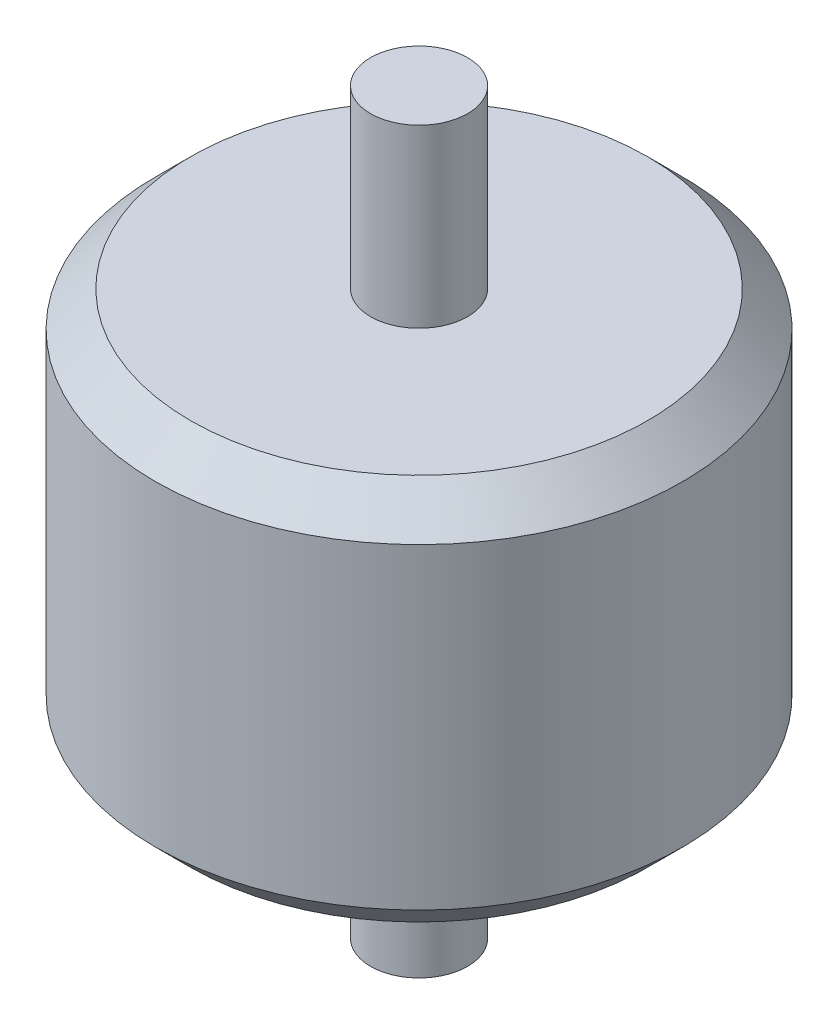
ISO-10303-21;
HEADER;
FILE_DESCRIPTION(('STEP AP214'),'2;1');
FILE_NAME('part.step','',(''),(''),'','','');
FILE_SCHEMA(('AUTOMOTIVE_DESIGN { 1 0 10303 214 1 1 1 1 }'));
ENDSEC;
DATA;
#1=APPLICATION_CONTEXT('core data for automotive mechanical design processes');
#2=APPLICATION_PROTOCOL_DEFINITION('international standard','automotive_design',2000,#1);
#3=PRODUCT_CONTEXT('',#1,'mechanical');
#4=PRODUCT('Part','Part','',(#3));
#5=PRODUCT_RELATED_PRODUCT_CATEGORY('part','',(#4));
#6=PRODUCT_DEFINITION_FORMATION('','',#4);
#7=PRODUCT_DEFINITION_CONTEXT('part definition',#1,'design');
#8=PRODUCT_DEFINITION('design','',#6,#7);
#9=PRODUCT_DEFINITION_SHAPE('','',#8);
#10=(LENGTH_UNIT() NAMED_UNIT(*) SI_UNIT(.MILLI.,.METRE.));
#11=(NAMED_UNIT(*) PLANE_ANGLE_UNIT() SI_UNIT($,.RADIAN.));
#12=(NAMED_UNIT(*) SI_UNIT($,.STERADIAN.) SOLID_ANGLE_UNIT());
#13=UNCERTAINTY_MEASURE_WITH_UNIT(LENGTH_MEASURE(1.E-05),#10,'distance_accuracy_value','');
#14=(GEOMETRIC_REPRESENTATION_CONTEXT(3) GLOBAL_UNCERTAINTY_ASSIGNED_CONTEXT((#13)) GLOBAL_UNIT_ASSIGNED_CONTEXT((#10,
#11,#12)) REPRESENTATION_CONTEXT('',''));
#15=CARTESIAN_POINT('',(0.,0.,0.));
#16=DIRECTION('',(0.,0.,1.));
#17=DIRECTION('',(1.,0.,0.));
#18=AXIS2_PLACEMENT_3D('',#15,#16,#17);
#19=CARTESIAN_POINT('',(0.,7.62,0.));
#20=DIRECTION('',(0.,-1.,0.));
#21=DIRECTION('',(0.,0.,-1.));
#22=AXIS2_PLACEMENT_3D('',#19,#20,#21);
#23=PLANE('',#22);
#24=CARTESIAN_POINT('',(0.,7.62,-9.525));
#25=DIRECTION('',(0.,1.,0.));
#26=DIRECTION('',(0.,0.,1.));
#27=AXIS2_PLACEMENT_3D('',#24,#25,#26);
#28=CIRCLE('',#27,1.7526);
#29=CARTESIAN_POINT('',(0.,7.62,-7.7724));
#30=VERTEX_POINT('',#29);
#31=EDGE_CURVE('E10',#30,#30,#28,.T.);
#32=ORIENTED_EDGE('',*,*,#31,.T.);
#33=EDGE_LOOP('',(#32));
#34=FACE_BOUND('',#33,.T.);
#35=ADVANCED_FACE('F37',(#34),#23,.F.);
#36=CARTESIAN_POINT('',(0.,7.62,-9.525));
#37=DIRECTION('',(0.,1.,0.));
#38=DIRECTION('',(0.,0.,1.));
#39=AXIS2_PLACEMENT_3D('',#36,#37,#38);
#40=CYLINDRICAL_SURFACE('',#39,1.7526);
#41=ORIENTED_EDGE('',*,*,#31,.F.);
#42=EDGE_LOOP('',(#41));
#43=FACE_BOUND('',#42,.T.);
#44=CARTESIAN_POINT('',(0.,1.27,-9.525));
#45=DIRECTION('',(0.,1.,0.));
#46=DIRECTION('',(0.,0.,1.));
#47=AXIS2_PLACEMENT_3D('',#44,#45,#46);
#48=CIRCLE('',#47,1.7526);
#49=CARTESIAN_POINT('',(0.,1.27,-7.7724));
#50=VERTEX_POINT('',#49);
#51=EDGE_CURVE('E43',#50,#50,#48,.T.);
#52=ORIENTED_EDGE('',*,*,#51,.T.);
#53=EDGE_LOOP('',(#52));
#54=FACE_BOUND('',#53,.T.);
#55=ADVANCED_FACE('F81',(#43,#54),#40,.T.);
#56=CARTESIAN_POINT('',(0.,1.27,0.));
#57=DIRECTION('',(0.,-1.,0.));
#58=DIRECTION('',(0.,0.,-1.));
#59=AXIS2_PLACEMENT_3D('',#56,#57,#58);
#60=PLANE('',#59);
#61=ORIENTED_EDGE('',*,*,#51,.F.);
#62=EDGE_LOOP('',(#61));
#63=FACE_BOUND('',#62,.T.);
#64=CARTESIAN_POINT('',(0.,1.27,-9.525));
#65=DIRECTION('',(0.,1.,0.));
#66=DIRECTION('',(0.,0.,1.));
#67=AXIS2_PLACEMENT_3D('',#64,#65,#66);
#68=CIRCLE('',#67,8.25500000000001);
#69=CARTESIAN_POINT('',(0.,1.27,-1.27));
#70=VERTEX_POINT('',#69);
#71=EDGE_CURVE('E47',#70,#70,#68,.T.);
#72=ORIENTED_EDGE('',*,*,#71,.T.);
#73=EDGE_LOOP('',(#72));
#74=FACE_BOUND('',#73,.T.);
#75=ADVANCED_FACE('F85',(#63,#74),#60,.F.);
#76=CARTESIAN_POINT('',(0.,0.,-9.525));
#77=DIRECTION('',(0.,-1.,0.));
#78=DIRECTION('',(0.,0.,-1.));
#79=AXIS2_PLACEMENT_3D('',#76,#77,#78);
#80=CONICAL_SURFACE('',#79,9.525,0.785398163397446);
#81=ORIENTED_EDGE('',*,*,#71,.F.);
#82=EDGE_LOOP('',(#81));
#83=FACE_BOUND('',#82,.T.);
#84=CARTESIAN_POINT('',(0.,0.,-9.525));
#85=DIRECTION('',(0.,1.,0.));
#86=DIRECTION('',(0.,0.,1.));
#87=AXIS2_PLACEMENT_3D('',#84,#85,#86);
#88=CIRCLE('',#87,9.525);
#89=CARTESIAN_POINT('',(0.,0.,0.));
#90=VERTEX_POINT('',#89);
#91=EDGE_CURVE('E51',#90,#90,#88,.T.);
#92=ORIENTED_EDGE('',*,*,#91,.T.);
#93=EDGE_LOOP('',(#92));
#94=FACE_BOUND('',#93,.T.);
#95=ADVANCED_FACE('F90',(#83,#94),#80,.T.);
#96=CARTESIAN_POINT('',(0.,7.62,-9.525));
#97=DIRECTION('',(0.,1.,0.));
#98=DIRECTION('',(0.,0.,1.));
#99=AXIS2_PLACEMENT_3D('',#96,#97,#98);
#100=CYLINDRICAL_SURFACE('',#99,9.525);
#101=CARTESIAN_POINT('',(0.,-11.43,-9.525));
#102=DIRECTION('',(0.,1.,0.));
#103=DIRECTION('',(0.,0.,1.));
#104=AXIS2_PLACEMENT_3D('',#101,#102,#103);
#105=CIRCLE('',#104,9.525);
#106=CARTESIAN_POINT('',(0.,-11.43,0.));
#107=VERTEX_POINT('',#106);
#108=EDGE_CURVE('E56',#107,#107,#105,.T.);
#109=ORIENTED_EDGE('',*,*,#108,.T.);
#110=EDGE_LOOP('',(#109));
#111=FACE_BOUND('',#110,.T.);
#112=ORIENTED_EDGE('',*,*,#91,.F.);
#113=EDGE_LOOP('',(#112));
#114=FACE_BOUND('',#113,.T.);
#115=ADVANCED_FACE('F96',(#111,#114),#100,.T.);
#116=CARTESIAN_POINT('',(0.,-11.43,-9.525));
#117=DIRECTION('',(0.,1.,0.));
#118=DIRECTION('',(0.,0.,1.));
#119=AXIS2_PLACEMENT_3D('',#116,#117,#118);
#120=CONICAL_SURFACE('',#119,9.525,0.785398163397459);
#121=CARTESIAN_POINT('',(0.,-12.7,-9.525));
#122=DIRECTION('',(0.,1.,0.));
#123=DIRECTION('',(0.,0.,1.));
#124=AXIS2_PLACEMENT_3D('',#121,#122,#123);
#125=CIRCLE('',#124,8.255);
#126=CARTESIAN_POINT('',(0.,-12.7,-1.27));
#127=VERTEX_POINT('',#126);
#128=EDGE_CURVE('E59',#127,#127,#125,.T.);
#129=ORIENTED_EDGE('',*,*,#128,.T.);
#130=EDGE_LOOP('',(#129));
#131=FACE_BOUND('',#130,.T.);
#132=ORIENTED_EDGE('',*,*,#108,.F.);
#133=EDGE_LOOP('',(#132));
#134=FACE_BOUND('',#133,.T.);
#135=ADVANCED_FACE('F100',(#131,#134),#120,.T.);
#136=CARTESIAN_POINT('',(0.,-12.7,0.));
#137=DIRECTION('',(0.,-1.,0.));
#138=DIRECTION('',(0.,0.,-1.));
#139=AXIS2_PLACEMENT_3D('',#136,#137,#138);
#140=PLANE('',#139);
#141=CARTESIAN_POINT('',(0.,-12.7,-9.525));
#142=DIRECTION('',(0.,1.,0.));
#143=DIRECTION('',(0.,0.,1.));
#144=AXIS2_PLACEMENT_3D('',#141,#142,#143);
#145=CIRCLE('',#144,1.7526);
#146=CARTESIAN_POINT('',(0.,-12.7,-7.7724));
#147=VERTEX_POINT('',#146);
#148=EDGE_CURVE('E62',#147,#147,#145,.T.);
#149=ORIENTED_EDGE('',*,*,#148,.T.);
#150=EDGE_LOOP('',(#149));
#151=FACE_BOUND('',#150,.T.);
#152=ORIENTED_EDGE('',*,*,#128,.F.);
#153=EDGE_LOOP('',(#152));
#154=FACE_BOUND('',#153,.T.);
#155=ADVANCED_FACE('F78',(#151,#154),#140,.T.);
#156=CARTESIAN_POINT('',(0.,7.62,-9.525));
#157=DIRECTION('',(0.,1.,0.));
#158=DIRECTION('',(0.,0.,1.));
#159=AXIS2_PLACEMENT_3D('',#156,#157,#158);
#160=CYLINDRICAL_SURFACE('',#159,1.7526);
#161=CARTESIAN_POINT('',(0.,-19.05,-9.525));
#162=DIRECTION('',(0.,1.,0.));
#163=DIRECTION('',(0.,0.,1.));
#164=AXIS2_PLACEMENT_3D('',#161,#162,#163);
#165=CIRCLE('',#164,1.7526);
#166=CARTESIAN_POINT('',(0.,-19.05,-7.7724));
#167=VERTEX_POINT('',#166);
#168=EDGE_CURVE('E65',#167,#167,#165,.T.);
#169=ORIENTED_EDGE('',*,*,#168,.T.);
#170=EDGE_LOOP('',(#169));
#171=FACE_BOUND('',#170,.T.);
#172=ORIENTED_EDGE('',*,*,#148,.F.);
#173=EDGE_LOOP('',(#172));
#174=FACE_BOUND('',#173,.T.);
#175=ADVANCED_FACE('F69',(#171,#174),#160,.T.);
#176=CARTESIAN_POINT('',(0.,-19.05,0.));
#177=DIRECTION('',(0.,-1.,0.));
#178=DIRECTION('',(0.,0.,-1.));
#179=AXIS2_PLACEMENT_3D('',#176,#177,#178);
#180=PLANE('',#179);
#181=ORIENTED_EDGE('',*,*,#168,.F.);
#182=EDGE_LOOP('',(#181));
#183=FACE_BOUND('',#182,.T.);
#184=ADVANCED_FACE('F72',(#183),#180,.T.);
#185=CLOSED_SHELL('',(#35,#55,#75,#95,#115,#135,#155,#175,#184));
#186=MANIFOLD_SOLID_BREP('B2',#185);
#187=ADVANCED_BREP_SHAPE_REPRESENTATION('',(#18,#186),#14);
#188=SHAPE_DEFINITION_REPRESENTATION(#9,#187);
ENDSEC;
END-ISO-10303-21;
